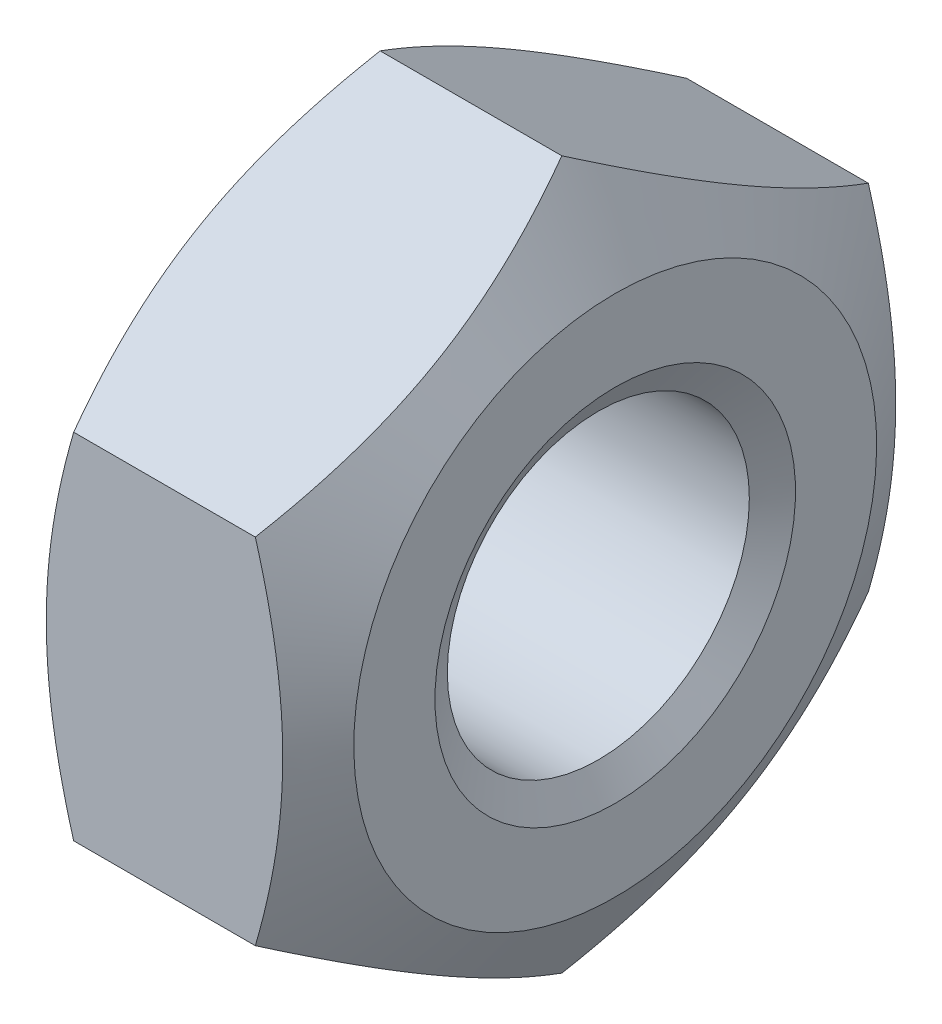
ISO-10303-21;
HEADER;
FILE_DESCRIPTION(('STEP AP214'),'2;1');
FILE_NAME('part.step','',(''),(''),'','','');
FILE_SCHEMA(('AUTOMOTIVE_DESIGN { 1 0 10303 214 1 1 1 1 }'));
ENDSEC;
DATA;
#1=APPLICATION_CONTEXT('core data for automotive mechanical design processes');
#2=APPLICATION_PROTOCOL_DEFINITION('international standard','automotive_design',2000,#1);
#3=PRODUCT_CONTEXT('',#1,'mechanical');
#4=PRODUCT('Part','Part','',(#3));
#5=PRODUCT_RELATED_PRODUCT_CATEGORY('part','',(#4));
#6=PRODUCT_DEFINITION_FORMATION('','',#4);
#7=PRODUCT_DEFINITION_CONTEXT('part definition',#1,'design');
#8=PRODUCT_DEFINITION('design','',#6,#7);
#9=PRODUCT_DEFINITION_SHAPE('','',#8);
#10=(LENGTH_UNIT() NAMED_UNIT(*) SI_UNIT(.MILLI.,.METRE.));
#11=(NAMED_UNIT(*) PLANE_ANGLE_UNIT() SI_UNIT($,.RADIAN.));
#12=(NAMED_UNIT(*) SI_UNIT($,.STERADIAN.) SOLID_ANGLE_UNIT());
#13=UNCERTAINTY_MEASURE_WITH_UNIT(LENGTH_MEASURE(1.E-05),#10,'distance_accuracy_value','');
#14=(GEOMETRIC_REPRESENTATION_CONTEXT(3) GLOBAL_UNCERTAINTY_ASSIGNED_CONTEXT((#13)) GLOBAL_UNIT_ASSIGNED_CONTEXT((#10,
#11,#12)) REPRESENTATION_CONTEXT('',''));
#15=CARTESIAN_POINT('',(0.,0.,0.));
#16=DIRECTION('',(0.,0.,1.));
#17=DIRECTION('',(1.,0.,0.));
#18=AXIS2_PLACEMENT_3D('',#15,#16,#17);
#19=CARTESIAN_POINT('',(0.234375,0.,0.));
#20=DIRECTION('',(-1.,0.,0.));
#21=DIRECTION('',(0.,0.,1.));
#22=AXIS2_PLACEMENT_3D('',#19,#20,#21);
#23=CONICAL_SURFACE('',#22,4.59394940802396,1.0471975511966);
#24=CARTESIAN_POINT('',(0.46875,0.,0.));
#25=DIRECTION('',(1.,0.,0.));
#26=DIRECTION('',(0.,1.,0.));
#27=AXIS2_PLACEMENT_3D('',#24,#25,#26);
#28=CIRCLE('',#27,4.188);
#29=CARTESIAN_POINT('',(0.46875,4.188,0.));
#30=VERTEX_POINT('',#29);
#31=EDGE_CURVE('E10',#30,#30,#28,.T.);
#32=ORIENTED_EDGE('',*,*,#31,.T.);
#33=EDGE_LOOP('',(#32));
#34=FACE_BOUND('',#33,.T.);
#35=CARTESIAN_POINT('',(0.,0.,0.));
#36=DIRECTION('',(-1.,0.,0.));
#37=DIRECTION('',(0.,0.,1.));
#38=AXIS2_PLACEMENT_3D('',#35,#36,#37);
#39=CIRCLE('',#38,4.99989881604791);
#40=CARTESIAN_POINT('',(0.,0.,4.99989881604791));
#41=VERTEX_POINT('',#40);
#42=EDGE_CURVE('E26',#41,#41,#39,.T.);
#43=ORIENTED_EDGE('',*,*,#42,.T.);
#44=EDGE_LOOP('',(#43));
#45=FACE_BOUND('',#44,.T.);
#46=ADVANCED_FACE('F16',(#34,#45),#23,.F.);
#47=CARTESIAN_POINT('',(-19.1722898065904,0.,0.));
#48=DIRECTION('',(1.,0.,0.));
#49=DIRECTION('',(0.,1.,0.));
#50=AXIS2_PLACEMENT_3D('',#47,#48,#49);
#51=CYLINDRICAL_SURFACE('',#50,4.188);
#52=CARTESIAN_POINT('',(7.53125,0.,0.));
#53=DIRECTION('',(-1.,0.,0.));
#54=DIRECTION('',(0.,0.,1.));
#55=AXIS2_PLACEMENT_3D('',#52,#53,#54);
#56=CIRCLE('',#55,4.188);
#57=CARTESIAN_POINT('',(7.53125,0.,4.188));
#58=VERTEX_POINT('',#57);
#59=EDGE_CURVE('E191',#58,#58,#56,.T.);
#60=ORIENTED_EDGE('',*,*,#59,.F.);
#61=EDGE_LOOP('',(#60));
#62=FACE_BOUND('',#61,.T.);
#63=ORIENTED_EDGE('',*,*,#31,.F.);
#64=EDGE_LOOP('',(#63));
#65=FACE_BOUND('',#64,.T.);
#66=ADVANCED_FACE('F204',(#62,#65),#51,.F.);
#67=CARTESIAN_POINT('',(0.,0.,0.));
#68=DIRECTION('',(1.,0.,0.));
#69=DIRECTION('',(0.,0.,-1.));
#70=AXIS2_PLACEMENT_3D('',#67,#68,#69);
#71=PLANE('',#70);
#72=CARTESIAN_POINT('',(0.,0.,0.));
#73=DIRECTION('',(-1.,0.,0.));
#74=DIRECTION('',(0.,0.,1.));
#75=AXIS2_PLACEMENT_3D('',#72,#73,#74);
#76=CIRCLE('',#75,7.25);
#77=CARTESIAN_POINT('',(0.,0.,7.25));
#78=VERTEX_POINT('',#77);
#79=EDGE_CURVE('E192',#78,#78,#76,.T.);
#80=ORIENTED_EDGE('',*,*,#79,.T.);
#81=EDGE_LOOP('',(#80));
#82=FACE_BOUND('',#81,.T.);
#83=ORIENTED_EDGE('',*,*,#42,.F.);
#84=EDGE_LOOP('',(#83));
#85=FACE_BOUND('',#84,.T.);
#86=ADVANCED_FACE('F201',(#82,#85),#71,.F.);
#87=CARTESIAN_POINT('',(7.765625,0.,0.));
#88=DIRECTION('',(1.,0.,0.));
#89=DIRECTION('',(0.,1.,0.));
#90=AXIS2_PLACEMENT_3D('',#87,#88,#89);
#91=CONICAL_SURFACE('',#90,4.59394940802396,1.0471975511966);
#92=ORIENTED_EDGE('',*,*,#59,.T.);
#93=EDGE_LOOP('',(#92));
#94=FACE_BOUND('',#93,.T.);
#95=CARTESIAN_POINT('',(8.,0.,0.));
#96=DIRECTION('',(1.,0.,0.));
#97=DIRECTION('',(0.,1.,0.));
#98=AXIS2_PLACEMENT_3D('',#95,#96,#97);
#99=CIRCLE('',#98,4.99989881604791);
#100=CARTESIAN_POINT('',(8.,4.99989881604791,0.));
#101=VERTEX_POINT('',#100);
#102=EDGE_CURVE('E188',#101,#101,#99,.T.);
#103=ORIENTED_EDGE('',*,*,#102,.T.);
#104=EDGE_LOOP('',(#103));
#105=FACE_BOUND('',#104,.T.);
#106=ADVANCED_FACE('F203',(#94,#105),#91,.F.);
#107=CARTESIAN_POINT('',(8.,0.,0.));
#108=DIRECTION('',(1.,0.,0.));
#109=DIRECTION('',(0.,0.,-1.));
#110=AXIS2_PLACEMENT_3D('',#107,#108,#109);
#111=PLANE('',#110);
#112=CARTESIAN_POINT('',(8.,0.,0.));
#113=DIRECTION('',(1.,0.,0.));
#114=DIRECTION('',(0.,1.,0.));
#115=AXIS2_PLACEMENT_3D('',#112,#113,#114);
#116=CIRCLE('',#115,7.25);
#117=CARTESIAN_POINT('',(8.,7.25,0.));
#118=VERTEX_POINT('',#117);
#119=EDGE_CURVE('E171',#118,#118,#116,.T.);
#120=ORIENTED_EDGE('',*,*,#119,.T.);
#121=EDGE_LOOP('',(#120));
#122=FACE_BOUND('',#121,.T.);
#123=ORIENTED_EDGE('',*,*,#102,.F.);
#124=EDGE_LOOP('',(#123));
#125=FACE_BOUND('',#124,.T.);
#126=ADVANCED_FACE('F212',(#122,#125),#111,.T.);
#127=CARTESIAN_POINT('',(0.740438607520939,0.,0.));
#128=DIRECTION('',(1.,0.,0.));
#129=DIRECTION('',(0.,0.,1.));
#130=AXIS2_PLACEMENT_3D('',#127,#128,#129);
#131=CONICAL_SURFACE('',#130,8.53247728811182,1.0471975511966);
#132=CARTESIAN_POINT('',(1.48087721504188,4.90747728811182,8.5));
#133=CARTESIAN_POINT('',(0.0642105483752115,0.,8.5));
#134=CARTESIAN_POINT('',(1.48087721504188,-4.90747728811182,8.5));
#135=(BOUNDED_CURVE() B_SPLINE_CURVE(2,(#132,#133,#134),.UNSPECIFIED.,.F.,
.F.) B_SPLINE_CURVE_WITH_KNOTS((3,3),(0.,0.993170717366231),
.UNSPECIFIED.) CURVE() GEOMETRIC_REPRESENTATION_ITEM() RATIONAL_B_SPLINE_CURVE((1.,
1.15470053837925,1.)) REPRESENTATION_ITEM(''));
#136=CARTESIAN_POINT('',(1.48087721504188,4.90747728811182,8.5));
#137=VERTEX_POINT('',#136);
#138=CARTESIAN_POINT('',(1.48087721504188,-4.90747728811182,8.5));
#139=VERTEX_POINT('',#138);
#140=EDGE_CURVE('E35',#137,#139,#135,.T.);
#141=ORIENTED_EDGE('',*,*,#140,.F.);
#142=CARTESIAN_POINT('',(1.48087721504188,9.81495457622364,0.));
#143=CARTESIAN_POINT('',(0.0642105483752134,7.36121593216773,4.25));
#144=CARTESIAN_POINT('',(1.48087721504188,4.90747728811181,8.5));
#145=(BOUNDED_CURVE() B_SPLINE_CURVE(2,(#142,#143,#144),.UNSPECIFIED.,.F.,
.F.) B_SPLINE_CURVE_WITH_KNOTS((3,3),(0.,0.993170717366231),
.UNSPECIFIED.) CURVE() GEOMETRIC_REPRESENTATION_ITEM() RATIONAL_B_SPLINE_CURVE((1.,
1.15470053837925,1.)) REPRESENTATION_ITEM(''));
#146=CARTESIAN_POINT('',(1.48087721504188,9.81495457622364,0.));
#147=VERTEX_POINT('',#146);
#148=EDGE_CURVE('E80',#147,#137,#145,.T.);
#149=ORIENTED_EDGE('',*,*,#148,.F.);
#150=CARTESIAN_POINT('',(1.48087721504188,4.90747728811185,-8.49999999999998));
#151=CARTESIAN_POINT('',(0.0642105483752217,7.36121593216774,-4.25));
#152=CARTESIAN_POINT('',(1.48087721504188,9.81495457622364,0.));
#153=(BOUNDED_CURVE() B_SPLINE_CURVE(2,(#150,#151,#152),.UNSPECIFIED.,.F.,
.F.) B_SPLINE_CURVE_WITH_KNOTS((3,3),(0.,0.993170717366227),
.UNSPECIFIED.) CURVE() GEOMETRIC_REPRESENTATION_ITEM() RATIONAL_B_SPLINE_CURVE((1.,
1.15470053837925,1.)) REPRESENTATION_ITEM(''));
#154=CARTESIAN_POINT('',(1.48087721504188,4.90747728811184,-8.49999999999999));
#155=VERTEX_POINT('',#154);
#156=EDGE_CURVE('E164',#155,#147,#153,.T.);
#157=ORIENTED_EDGE('',*,*,#156,.F.);
#158=CARTESIAN_POINT('',(1.48087721504188,-4.90747728811178,-8.50000000000002));
#159=CARTESIAN_POINT('',(0.0642105483752256,0.,-8.50000000000001));
#160=CARTESIAN_POINT('',(1.48087721504188,4.90747728811182,-8.5));
#161=(BOUNDED_CURVE() B_SPLINE_CURVE(2,(#158,#159,#160),.UNSPECIFIED.,.F.,
.F.) B_SPLINE_CURVE_WITH_KNOTS((3,3),(0.,0.993170717366226),
.UNSPECIFIED.) CURVE() GEOMETRIC_REPRESENTATION_ITEM() RATIONAL_B_SPLINE_CURVE((1.,
1.15470053837925,1.)) REPRESENTATION_ITEM(''));
#162=CARTESIAN_POINT('',(1.48087721504188,-4.90747728811178,-8.50000000000002));
#163=VERTEX_POINT('',#162);
#164=EDGE_CURVE('E88',#163,#155,#161,.T.);
#165=ORIENTED_EDGE('',*,*,#164,.F.);
#166=CARTESIAN_POINT('',(1.48087721504188,-9.81495457622364,0.));
#167=CARTESIAN_POINT('',(0.064210548375209,-7.36121593216772,-4.25));
#168=CARTESIAN_POINT('',(1.48087721504188,-4.9074772881118,-8.50000000000001));
#169=(BOUNDED_CURVE() B_SPLINE_CURVE(2,(#166,#167,#168),.UNSPECIFIED.,.F.,
.F.) B_SPLINE_CURVE_WITH_KNOTS((3,3),(0.,0.993170717366232),
.UNSPECIFIED.) CURVE() GEOMETRIC_REPRESENTATION_ITEM() RATIONAL_B_SPLINE_CURVE((1.,
1.15470053837925,1.)) REPRESENTATION_ITEM(''));
#170=CARTESIAN_POINT('',(1.48087721504188,-9.81495457622364,0.));
#171=VERTEX_POINT('',#170);
#172=EDGE_CURVE('E99',#171,#163,#169,.T.);
#173=ORIENTED_EDGE('',*,*,#172,.F.);
#174=CARTESIAN_POINT('',(1.48087721504188,-4.90747728811182,8.49999999999999));
#175=CARTESIAN_POINT('',(0.0642105483752162,-7.36121593216773,4.25));
#176=CARTESIAN_POINT('',(1.48087721504188,-9.81495457622364,0.));
#177=(BOUNDED_CURVE() B_SPLINE_CURVE(2,(#174,#175,#176),.UNSPECIFIED.,.F.,
.F.) B_SPLINE_CURVE_WITH_KNOTS((3,3),(0.,0.99317071736623),
.UNSPECIFIED.) CURVE() GEOMETRIC_REPRESENTATION_ITEM() RATIONAL_B_SPLINE_CURVE((1.,
1.15470053837926,1.)) REPRESENTATION_ITEM(''));
#178=EDGE_CURVE('E132',#139,#171,#177,.T.);
#179=ORIENTED_EDGE('',*,*,#178,.F.);
#180=EDGE_LOOP('',(#141,#149,#157,#165,#173,#179));
#181=FACE_BOUND('',#180,.T.);
#182=ORIENTED_EDGE('',*,*,#79,.F.);
#183=EDGE_LOOP('',(#182));
#184=FACE_BOUND('',#183,.T.);
#185=ADVANCED_FACE('F224',(#181,#184),#131,.T.);
#186=CARTESIAN_POINT('',(7.25956139247906,0.,0.));
#187=DIRECTION('',(-1.,0.,0.));
#188=DIRECTION('',(0.,0.,1.));
#189=AXIS2_PLACEMENT_3D('',#186,#187,#188);
#190=CONICAL_SURFACE('',#189,8.53247728811182,1.0471975511966);
#191=CARTESIAN_POINT('',(6.51912278495812,4.90747728811181,8.50000000000001));
#192=CARTESIAN_POINT('',(7.93578945162479,7.36121593216773,4.25));
#193=CARTESIAN_POINT('',(6.51912278495812,9.81495457622364,0.));
#194=(BOUNDED_CURVE() B_SPLINE_CURVE(2,(#191,#192,#193),.UNSPECIFIED.,.F.,
.F.) B_SPLINE_CURVE_WITH_KNOTS((3,3),(0.,0.993170717366232),
.UNSPECIFIED.) CURVE() GEOMETRIC_REPRESENTATION_ITEM() RATIONAL_B_SPLINE_CURVE((1.,
1.15470053837925,1.)) REPRESENTATION_ITEM(''));
#195=CARTESIAN_POINT('',(6.51912278495812,4.90747728811182,8.5));
#196=VERTEX_POINT('',#195);
#197=CARTESIAN_POINT('',(6.51912278495812,9.81495457622364,0.));
#198=VERTEX_POINT('',#197);
#199=EDGE_CURVE('E102',#196,#198,#194,.T.);
#200=ORIENTED_EDGE('',*,*,#199,.F.);
#201=CARTESIAN_POINT('',(6.51912278495812,-4.90747728811183,8.5));
#202=CARTESIAN_POINT('',(7.93578945162479,0.,8.5));
#203=CARTESIAN_POINT('',(6.51912278495812,4.90747728811183,8.5));
#204=(BOUNDED_CURVE() B_SPLINE_CURVE(2,(#201,#202,#203),.UNSPECIFIED.,.F.,
.F.) B_SPLINE_CURVE_WITH_KNOTS((3,3),(0.,0.993170717366233),
.UNSPECIFIED.) CURVE() GEOMETRIC_REPRESENTATION_ITEM() RATIONAL_B_SPLINE_CURVE((1.,
1.15470053837925,1.)) REPRESENTATION_ITEM(''));
#205=CARTESIAN_POINT('',(6.51912278495812,-4.90747728811182,8.5));
#206=VERTEX_POINT('',#205);
#207=EDGE_CURVE('E105',#206,#196,#204,.T.);
#208=ORIENTED_EDGE('',*,*,#207,.F.);
#209=CARTESIAN_POINT('',(6.51912278495812,-9.81495457622364,0.));
#210=CARTESIAN_POINT('',(7.93578945162479,-7.36121593216773,4.25));
#211=CARTESIAN_POINT('',(6.51912278495812,-4.90747728811182,8.5));
#212=(BOUNDED_CURVE() B_SPLINE_CURVE(2,(#209,#210,#211),.UNSPECIFIED.,.F.,
.F.) B_SPLINE_CURVE_WITH_KNOTS((3,3),(0.,0.993170717366231),
.UNSPECIFIED.) CURVE() GEOMETRIC_REPRESENTATION_ITEM() RATIONAL_B_SPLINE_CURVE((1.,
1.15470053837926,1.)) REPRESENTATION_ITEM(''));
#213=CARTESIAN_POINT('',(6.51912278495812,-9.81495457622364,0.));
#214=VERTEX_POINT('',#213);
#215=EDGE_CURVE('E120',#214,#206,#212,.T.);
#216=ORIENTED_EDGE('',*,*,#215,.F.);
#217=CARTESIAN_POINT('',(6.51912278495812,-4.9074772881118,-8.50000000000001));
#218=CARTESIAN_POINT('',(7.93578945162479,-7.36121593216772,-4.25));
#219=CARTESIAN_POINT('',(6.51912278495812,-9.81495457622364,0.));
#220=(BOUNDED_CURVE() B_SPLINE_CURVE(2,(#217,#218,#219),.UNSPECIFIED.,.F.,
.F.) B_SPLINE_CURVE_WITH_KNOTS((3,3),(0.,0.993170717366233),
.UNSPECIFIED.) CURVE() GEOMETRIC_REPRESENTATION_ITEM() RATIONAL_B_SPLINE_CURVE((1.,
1.15470053837925,1.)) REPRESENTATION_ITEM(''));
#221=CARTESIAN_POINT('',(6.51912278495812,-4.90747728811178,-8.50000000000002));
#222=VERTEX_POINT('',#221);
#223=EDGE_CURVE('E66',#222,#214,#220,.T.);
#224=ORIENTED_EDGE('',*,*,#223,.F.);
#225=CARTESIAN_POINT('',(6.51912278495812,4.90747728811182,-8.5));
#226=CARTESIAN_POINT('',(7.93578945162478,0.,-8.50000000000001));
#227=CARTESIAN_POINT('',(6.51912278495812,-4.90747728811178,-8.50000000000002));
#228=(BOUNDED_CURVE() B_SPLINE_CURVE(2,(#225,#226,#227),.UNSPECIFIED.,.F.,
.F.) B_SPLINE_CURVE_WITH_KNOTS((3,3),(0.,0.993170717366227),
.UNSPECIFIED.) CURVE() GEOMETRIC_REPRESENTATION_ITEM() RATIONAL_B_SPLINE_CURVE((1.,
1.15470053837925,1.)) REPRESENTATION_ITEM(''));
#229=CARTESIAN_POINT('',(6.51912278495812,4.90747728811184,-8.49999999999999));
#230=VERTEX_POINT('',#229);
#231=EDGE_CURVE('E69',#230,#222,#228,.T.);
#232=ORIENTED_EDGE('',*,*,#231,.F.);
#233=CARTESIAN_POINT('',(6.51912278495812,9.81495457622364,0.));
#234=CARTESIAN_POINT('',(7.93578945162478,7.36121593216775,-4.24999999999999));
#235=CARTESIAN_POINT('',(6.51912278495812,4.90747728811185,-8.49999999999999));
#236=(BOUNDED_CURVE() B_SPLINE_CURVE(2,(#233,#234,#235),.UNSPECIFIED.,.F.,
.F.) B_SPLINE_CURVE_WITH_KNOTS((3,3),(0.,0.993170717366228),
.UNSPECIFIED.) CURVE() GEOMETRIC_REPRESENTATION_ITEM() RATIONAL_B_SPLINE_CURVE((1.,
1.15470053837925,1.)) REPRESENTATION_ITEM(''));
#237=EDGE_CURVE('E73',#198,#230,#236,.T.);
#238=ORIENTED_EDGE('',*,*,#237,.F.);
#239=EDGE_LOOP('',(#200,#208,#216,#224,#232,#238));
#240=FACE_BOUND('',#239,.T.);
#241=ORIENTED_EDGE('',*,*,#119,.F.);
#242=EDGE_LOOP('',(#241));
#243=FACE_BOUND('',#242,.T.);
#244=ADVANCED_FACE('F18',(#240,#243),#190,.T.);
#245=CARTESIAN_POINT('',(0.,9.81495457622364,0.));
#246=DIRECTION('',(0.,0.86602540378444,-0.499999999999999));
#247=DIRECTION('',(0.,0.499999999999999,0.86602540378444));
#248=AXIS2_PLACEMENT_3D('',#245,#246,#247);
#249=PLANE('',#248);
#250=ORIENTED_EDGE('',*,*,#156,.T.);
#251=DIRECTION('',(1.,0.,0.));
#252=VECTOR('',#251,1.);
#253=CARTESIAN_POINT('',(0.,9.81495457622364,0.));
#254=LINE('',#253,#252);
#255=EDGE_CURVE('E87',#147,#198,#254,.T.);
#256=ORIENTED_EDGE('',*,*,#255,.T.);
#257=ORIENTED_EDGE('',*,*,#237,.T.);
#258=DIRECTION('',(1.,0.,0.));
#259=VECTOR('',#258,1.);
#260=CARTESIAN_POINT('',(0.,4.90747728811184,-8.5));
#261=LINE('',#260,#259);
#262=EDGE_CURVE('E79',#155,#230,#261,.T.);
#263=ORIENTED_EDGE('',*,*,#262,.F.);
#264=EDGE_LOOP('',(#250,#256,#257,#263));
#265=FACE_BOUND('',#264,.T.);
#266=ADVANCED_FACE('F85',(#265),#249,.T.);
#267=CARTESIAN_POINT('',(0.,4.90747728811184,-8.5));
#268=DIRECTION('',(0.,0.,-1.));
#269=DIRECTION('',(0.,1.,0.));
#270=AXIS2_PLACEMENT_3D('',#267,#268,#269);
#271=PLANE('',#270);
#272=ORIENTED_EDGE('',*,*,#164,.T.);
#273=ORIENTED_EDGE('',*,*,#262,.T.);
#274=ORIENTED_EDGE('',*,*,#231,.T.);
#275=DIRECTION('',(1.,0.,0.));
#276=VECTOR('',#275,1.);
#277=CARTESIAN_POINT('',(0.,-4.9074772881118,-8.50000000000002));
#278=LINE('',#277,#276);
#279=EDGE_CURVE('E97',#163,#222,#278,.T.);
#280=ORIENTED_EDGE('',*,*,#279,.F.);
#281=EDGE_LOOP('',(#272,#273,#274,#280));
#282=FACE_BOUND('',#281,.T.);
#283=ADVANCED_FACE('F90',(#282),#271,.T.);
#284=CARTESIAN_POINT('',(0.,4.90747728811182,8.5));
#285=DIRECTION('',(0.,0.866025403784438,0.500000000000001));
#286=DIRECTION('',(0.,-0.500000000000001,0.866025403784438));
#287=AXIS2_PLACEMENT_3D('',#284,#285,#286);
#288=PLANE('',#287);
#289=ORIENTED_EDGE('',*,*,#148,.T.);
#290=DIRECTION('',(1.,0.,0.));
#291=VECTOR('',#290,1.);
#292=CARTESIAN_POINT('',(0.,4.90747728811182,8.5));
#293=LINE('',#292,#291);
#294=EDGE_CURVE('E100',#137,#196,#293,.T.);
#295=ORIENTED_EDGE('',*,*,#294,.T.);
#296=ORIENTED_EDGE('',*,*,#199,.T.);
#297=ORIENTED_EDGE('',*,*,#255,.F.);
#298=EDGE_LOOP('',(#289,#295,#296,#297));
#299=FACE_BOUND('',#298,.T.);
#300=ADVANCED_FACE('F241',(#299),#288,.T.);
#301=CARTESIAN_POINT('',(0.,-4.90747728811182,8.5));
#302=DIRECTION('',(0.,0.,1.));
#303=DIRECTION('',(1.,0.,0.));
#304=AXIS2_PLACEMENT_3D('',#301,#302,#303);
#305=PLANE('',#304);
#306=ORIENTED_EDGE('',*,*,#140,.T.);
#307=DIRECTION('',(1.,0.,0.));
#308=VECTOR('',#307,1.);
#309=CARTESIAN_POINT('',(0.,-4.90747728811182,8.5));
#310=LINE('',#309,#308);
#311=EDGE_CURVE('E103',#139,#206,#310,.T.);
#312=ORIENTED_EDGE('',*,*,#311,.T.);
#313=ORIENTED_EDGE('',*,*,#207,.T.);
#314=ORIENTED_EDGE('',*,*,#294,.F.);
#315=EDGE_LOOP('',(#306,#312,#313,#314));
#316=FACE_BOUND('',#315,.T.);
#317=ADVANCED_FACE('F244',(#316),#305,.T.);
#318=CARTESIAN_POINT('',(0.,-4.9074772881118,-8.50000000000002));
#319=DIRECTION('',(0.,-0.866025403784438,-0.500000000000001));
#320=DIRECTION('',(0.,0.500000000000001,-0.866025403784438));
#321=AXIS2_PLACEMENT_3D('',#318,#319,#320);
#322=PLANE('',#321);
#323=ORIENTED_EDGE('',*,*,#172,.T.);
#324=ORIENTED_EDGE('',*,*,#279,.T.);
#325=ORIENTED_EDGE('',*,*,#223,.T.);
#326=DIRECTION('',(1.,0.,0.));
#327=VECTOR('',#326,1.);
#328=CARTESIAN_POINT('',(0.,-9.81495457622364,0.));
#329=LINE('',#328,#327);
#330=EDGE_CURVE('E20',#171,#214,#329,.T.);
#331=ORIENTED_EDGE('',*,*,#330,.F.);
#332=EDGE_LOOP('',(#323,#324,#325,#331));
#333=FACE_BOUND('',#332,.T.);
#334=ADVANCED_FACE('F248',(#333),#322,.T.);
#335=CARTESIAN_POINT('',(0.,-9.81495457622364,0.));
#336=DIRECTION('',(0.,-0.866025403784439,0.5));
#337=DIRECTION('',(0.,-0.5,-0.866025403784439));
#338=AXIS2_PLACEMENT_3D('',#335,#336,#337);
#339=PLANE('',#338);
#340=ORIENTED_EDGE('',*,*,#178,.T.);
#341=ORIENTED_EDGE('',*,*,#330,.T.);
#342=ORIENTED_EDGE('',*,*,#215,.T.);
#343=ORIENTED_EDGE('',*,*,#311,.F.);
#344=EDGE_LOOP('',(#340,#341,#342,#343));
#345=FACE_BOUND('',#344,.T.);
#346=ADVANCED_FACE('F250',(#345),#339,.T.);
#347=CLOSED_SHELL('',(#46,#66,#86,#106,#126,#185,#244,#266,#283,#300,#317,#334,#346));
#348=MANIFOLD_SOLID_BREP('B1',#347);
#349=ADVANCED_BREP_SHAPE_REPRESENTATION('',(#18,#348),#14);
#350=SHAPE_DEFINITION_REPRESENTATION(#9,#349);
ENDSEC;
END-ISO-10303-21;
